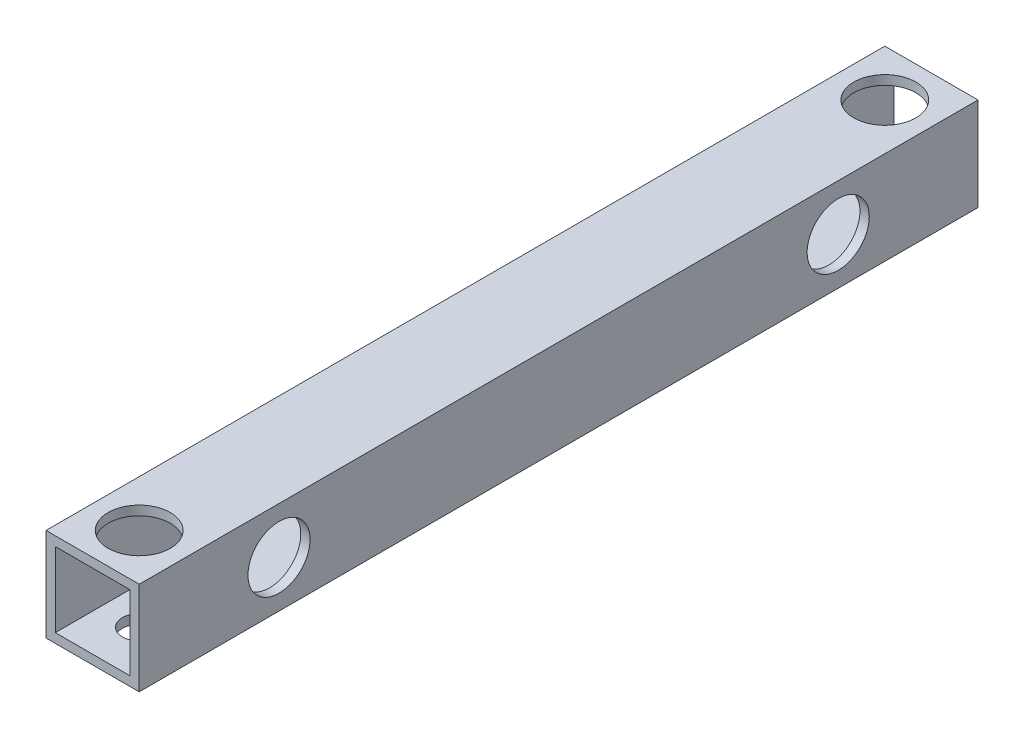
ISO-10303-21;
HEADER;
FILE_DESCRIPTION(('STEP AP214'),'2;1');
FILE_NAME('part.step','',(''),(''),'','','');
FILE_SCHEMA(('AUTOMOTIVE_DESIGN { 1 0 10303 214 1 1 1 1 }'));
ENDSEC;
DATA;
#1=APPLICATION_CONTEXT('core data for automotive mechanical design processes');
#2=APPLICATION_PROTOCOL_DEFINITION('international standard','automotive_design',2000,#1);
#3=PRODUCT_CONTEXT('',#1,'mechanical');
#4=PRODUCT('Part','Part','',(#3));
#5=PRODUCT_RELATED_PRODUCT_CATEGORY('part','',(#4));
#6=PRODUCT_DEFINITION_FORMATION('','',#4);
#7=PRODUCT_DEFINITION_CONTEXT('part definition',#1,'design');
#8=PRODUCT_DEFINITION('design','',#6,#7);
#9=PRODUCT_DEFINITION_SHAPE('','',#8);
#10=(LENGTH_UNIT() NAMED_UNIT(*) SI_UNIT(.MILLI.,.METRE.));
#11=(NAMED_UNIT(*) PLANE_ANGLE_UNIT() SI_UNIT($,.RADIAN.));
#12=(NAMED_UNIT(*) SI_UNIT($,.STERADIAN.) SOLID_ANGLE_UNIT());
#13=UNCERTAINTY_MEASURE_WITH_UNIT(LENGTH_MEASURE(1.E-05),#10,'distance_accuracy_value','');
#14=(GEOMETRIC_REPRESENTATION_CONTEXT(3) GLOBAL_UNCERTAINTY_ASSIGNED_CONTEXT((#13)) GLOBAL_UNIT_ASSIGNED_CONTEXT((#10,
#11,#12)) REPRESENTATION_CONTEXT('',''));
#15=CARTESIAN_POINT('',(0.,0.,0.));
#16=DIRECTION('',(0.,0.,1.));
#17=DIRECTION('',(1.,0.,0.));
#18=AXIS2_PLACEMENT_3D('',#15,#16,#17);
#19=CARTESIAN_POINT('',(0.,0.,135.));
#20=DIRECTION('',(0.,0.,-1.));
#21=DIRECTION('',(-1.,0.,0.));
#22=AXIS2_PLACEMENT_3D('',#19,#20,#21);
#23=PLANE('',#22);
#24=DIRECTION('',(0.,1.,0.));
#25=VECTOR('',#24,1.);
#26=CARTESIAN_POINT('',(7.5,-7.5,135.));
#27=LINE('',#26,#25);
#28=CARTESIAN_POINT('',(7.5,-7.5,135.));
#29=VERTEX_POINT('',#28);
#30=CARTESIAN_POINT('',(7.5,7.5,135.));
#31=VERTEX_POINT('',#30);
#32=EDGE_CURVE('E144',#29,#31,#27,.T.);
#33=ORIENTED_EDGE('',*,*,#32,.T.);
#34=DIRECTION('',(-1.,0.,0.));
#35=VECTOR('',#34,1.);
#36=CARTESIAN_POINT('',(-7.5,7.5,135.));
#37=LINE('',#36,#35);
#38=CARTESIAN_POINT('',(-7.5,7.5,135.));
#39=VERTEX_POINT('',#38);
#40=EDGE_CURVE('E147',#31,#39,#37,.T.);
#41=ORIENTED_EDGE('',*,*,#40,.T.);
#42=DIRECTION('',(0.,-1.,0.));
#43=VECTOR('',#42,1.);
#44=CARTESIAN_POINT('',(-7.5,-7.5,135.));
#45=LINE('',#44,#43);
#46=CARTESIAN_POINT('',(-7.5,-7.5,135.));
#47=VERTEX_POINT('',#46);
#48=EDGE_CURVE('E150',#39,#47,#45,.T.);
#49=ORIENTED_EDGE('',*,*,#48,.T.);
#50=DIRECTION('',(1.,0.,0.));
#51=VECTOR('',#50,1.);
#52=CARTESIAN_POINT('',(-7.5,-7.5,135.));
#53=LINE('',#52,#51);
#54=EDGE_CURVE('E152',#47,#29,#53,.T.);
#55=ORIENTED_EDGE('',*,*,#54,.T.);
#56=EDGE_LOOP('',(#33,#41,#49,#55));
#57=FACE_BOUND('',#56,.T.);
#58=DIRECTION('',(0.,1.,0.));
#59=VECTOR('',#58,1.);
#60=CARTESIAN_POINT('',(6.,-6.,135.));
#61=LINE('',#60,#59);
#62=CARTESIAN_POINT('',(6.,-6.,135.));
#63=VERTEX_POINT('',#62);
#64=CARTESIAN_POINT('',(6.,6.,135.));
#65=VERTEX_POINT('',#64);
#66=EDGE_CURVE('E106',#63,#65,#61,.T.);
#67=ORIENTED_EDGE('',*,*,#66,.F.);
#68=DIRECTION('',(1.,0.,0.));
#69=VECTOR('',#68,1.);
#70=CARTESIAN_POINT('',(-6.,-6.,135.));
#71=LINE('',#70,#69);
#72=CARTESIAN_POINT('',(-6.,-6.,135.));
#73=VERTEX_POINT('',#72);
#74=EDGE_CURVE('E128',#73,#63,#71,.T.);
#75=ORIENTED_EDGE('',*,*,#74,.F.);
#76=DIRECTION('',(0.,-1.,0.));
#77=VECTOR('',#76,1.);
#78=CARTESIAN_POINT('',(-6.,-6.,135.));
#79=LINE('',#78,#77);
#80=CARTESIAN_POINT('',(-6.,6.,135.));
#81=VERTEX_POINT('',#80);
#82=EDGE_CURVE('E126',#81,#73,#79,.T.);
#83=ORIENTED_EDGE('',*,*,#82,.F.);
#84=DIRECTION('',(-1.,0.,0.));
#85=VECTOR('',#84,1.);
#86=CARTESIAN_POINT('',(-6.,6.,135.));
#87=LINE('',#86,#85);
#88=EDGE_CURVE('E114',#65,#81,#87,.T.);
#89=ORIENTED_EDGE('',*,*,#88,.F.);
#90=EDGE_LOOP('',(#67,#75,#83,#89));
#91=FACE_BOUND('',#90,.T.);
#92=ADVANCED_FACE('F39',(#57,#91),#23,.F.);
#93=CARTESIAN_POINT('',(0.,0.,0.));
#94=DIRECTION('',(0.,0.,-1.));
#95=DIRECTION('',(-1.,0.,0.));
#96=AXIS2_PLACEMENT_3D('',#93,#94,#95);
#97=PLANE('',#96);
#98=DIRECTION('',(0.,1.,0.));
#99=VECTOR('',#98,1.);
#100=CARTESIAN_POINT('',(7.5,-7.5,0.));
#101=LINE('',#100,#99);
#102=CARTESIAN_POINT('',(7.5,-7.5,0.));
#103=VERTEX_POINT('',#102);
#104=CARTESIAN_POINT('',(7.5,7.5,0.));
#105=VERTEX_POINT('',#104);
#106=EDGE_CURVE('E122',#103,#105,#101,.T.);
#107=ORIENTED_EDGE('',*,*,#106,.F.);
#108=DIRECTION('',(1.,0.,0.));
#109=VECTOR('',#108,1.);
#110=CARTESIAN_POINT('',(-7.5,-7.5,0.));
#111=LINE('',#110,#109);
#112=CARTESIAN_POINT('',(-7.5,-7.5,0.));
#113=VERTEX_POINT('',#112);
#114=EDGE_CURVE('E148',#113,#103,#111,.T.);
#115=ORIENTED_EDGE('',*,*,#114,.F.);
#116=DIRECTION('',(0.,-1.,0.));
#117=VECTOR('',#116,1.);
#118=CARTESIAN_POINT('',(-7.5,-7.5,0.));
#119=LINE('',#118,#117);
#120=CARTESIAN_POINT('',(-7.5,7.5,0.));
#121=VERTEX_POINT('',#120);
#122=EDGE_CURVE('E159',#121,#113,#119,.T.);
#123=ORIENTED_EDGE('',*,*,#122,.F.);
#124=DIRECTION('',(-1.,0.,0.));
#125=VECTOR('',#124,1.);
#126=CARTESIAN_POINT('',(-7.5,7.5,0.));
#127=LINE('',#126,#125);
#128=EDGE_CURVE('E157',#105,#121,#127,.T.);
#129=ORIENTED_EDGE('',*,*,#128,.F.);
#130=EDGE_LOOP('',(#107,#115,#123,#129));
#131=FACE_BOUND('',#130,.T.);
#132=DIRECTION('',(1.,0.,0.));
#133=VECTOR('',#132,1.);
#134=CARTESIAN_POINT('',(-6.,-6.,0.));
#135=LINE('',#134,#133);
#136=CARTESIAN_POINT('',(-6.,-6.,0.));
#137=VERTEX_POINT('',#136);
#138=CARTESIAN_POINT('',(6.,-6.,0.));
#139=VERTEX_POINT('',#138);
#140=EDGE_CURVE('E115',#137,#139,#135,.T.);
#141=ORIENTED_EDGE('',*,*,#140,.T.);
#142=DIRECTION('',(0.,1.,0.));
#143=VECTOR('',#142,1.);
#144=CARTESIAN_POINT('',(6.,-6.,0.));
#145=LINE('',#144,#143);
#146=CARTESIAN_POINT('',(6.,6.,0.));
#147=VERTEX_POINT('',#146);
#148=EDGE_CURVE('E64',#139,#147,#145,.T.);
#149=ORIENTED_EDGE('',*,*,#148,.T.);
#150=DIRECTION('',(-1.,0.,0.));
#151=VECTOR('',#150,1.);
#152=CARTESIAN_POINT('',(-6.,6.,0.));
#153=LINE('',#152,#151);
#154=CARTESIAN_POINT('',(-6.,6.,0.));
#155=VERTEX_POINT('',#154);
#156=EDGE_CURVE('E121',#147,#155,#153,.T.);
#157=ORIENTED_EDGE('',*,*,#156,.T.);
#158=DIRECTION('',(0.,-1.,0.));
#159=VECTOR('',#158,1.);
#160=CARTESIAN_POINT('',(-6.,-6.,0.));
#161=LINE('',#160,#159);
#162=EDGE_CURVE('E136',#155,#137,#161,.T.);
#163=ORIENTED_EDGE('',*,*,#162,.T.);
#164=EDGE_LOOP('',(#141,#149,#157,#163));
#165=FACE_BOUND('',#164,.T.);
#166=ADVANCED_FACE('F238',(#131,#165),#97,.T.);
#167=CARTESIAN_POINT('',(7.5,-7.5,135.));
#168=DIRECTION('',(-1.,0.,0.));
#169=DIRECTION('',(0.,0.,1.));
#170=AXIS2_PLACEMENT_3D('',#167,#168,#169);
#171=PLANE('',#170);
#172=CARTESIAN_POINT('',(7.5,0.,22.5));
#173=DIRECTION('',(1.,0.,0.));
#174=DIRECTION('',(0.,0.,-1.));
#175=AXIS2_PLACEMENT_3D('',#172,#173,#174);
#176=CIRCLE('',#175,5.);
#177=CARTESIAN_POINT('',(7.5,0.,17.5));
#178=VERTEX_POINT('',#177);
#179=EDGE_CURVE('E192',#178,#178,#176,.T.);
#180=ORIENTED_EDGE('',*,*,#179,.F.);
#181=EDGE_LOOP('',(#180));
#182=FACE_BOUND('',#181,.T.);
#183=CARTESIAN_POINT('',(7.5,0.,112.5));
#184=DIRECTION('',(1.,0.,0.));
#185=DIRECTION('',(0.,0.,-1.));
#186=AXIS2_PLACEMENT_3D('',#183,#184,#185);
#187=CIRCLE('',#186,5.);
#188=CARTESIAN_POINT('',(7.5,0.,107.5));
#189=VERTEX_POINT('',#188);
#190=EDGE_CURVE('E198',#189,#189,#187,.T.);
#191=ORIENTED_EDGE('',*,*,#190,.F.);
#192=EDGE_LOOP('',(#191));
#193=FACE_BOUND('',#192,.T.);
#194=ORIENTED_EDGE('',*,*,#106,.T.);
#195=DIRECTION('',(0.,0.,-1.));
#196=VECTOR('',#195,1.);
#197=CARTESIAN_POINT('',(7.5,7.5,135.));
#198=LINE('',#197,#196);
#199=EDGE_CURVE('E11',#31,#105,#198,.T.);
#200=ORIENTED_EDGE('',*,*,#199,.F.);
#201=ORIENTED_EDGE('',*,*,#32,.F.);
#202=DIRECTION('',(0.,0.,-1.));
#203=VECTOR('',#202,1.);
#204=CARTESIAN_POINT('',(7.5,-7.5,135.));
#205=LINE('',#204,#203);
#206=EDGE_CURVE('E154',#29,#103,#205,.T.);
#207=ORIENTED_EDGE('',*,*,#206,.T.);
#208=EDGE_LOOP('',(#194,#200,#201,#207));
#209=FACE_BOUND('',#208,.T.);
#210=ADVANCED_FACE('F41',(#182,#193,#209),#171,.F.);
#211=CARTESIAN_POINT('',(-7.5,7.5,135.));
#212=DIRECTION('',(0.,-1.,0.));
#213=DIRECTION('',(0.,0.,-1.));
#214=AXIS2_PLACEMENT_3D('',#211,#212,#213);
#215=PLANE('',#214);
#216=CARTESIAN_POINT('',(0.,7.5,127.5));
#217=DIRECTION('',(0.,1.,0.));
#218=DIRECTION('',(0.,0.,1.));
#219=AXIS2_PLACEMENT_3D('',#216,#217,#218);
#220=CIRCLE('',#219,5.);
#221=CARTESIAN_POINT('',(0.,7.5,132.5));
#222=VERTEX_POINT('',#221);
#223=EDGE_CURVE('E188',#222,#222,#220,.T.);
#224=ORIENTED_EDGE('',*,*,#223,.F.);
#225=EDGE_LOOP('',(#224));
#226=FACE_BOUND('',#225,.T.);
#227=CARTESIAN_POINT('',(0.,7.5,7.50000000000001));
#228=DIRECTION('',(0.,1.,0.));
#229=DIRECTION('',(0.,0.,1.));
#230=AXIS2_PLACEMENT_3D('',#227,#228,#229);
#231=CIRCLE('',#230,5.);
#232=CARTESIAN_POINT('',(0.,7.5,12.5));
#233=VERTEX_POINT('',#232);
#234=EDGE_CURVE('E196',#233,#233,#231,.T.);
#235=ORIENTED_EDGE('',*,*,#234,.F.);
#236=EDGE_LOOP('',(#235));
#237=FACE_BOUND('',#236,.T.);
#238=ORIENTED_EDGE('',*,*,#128,.T.);
#239=DIRECTION('',(0.,0.,-1.));
#240=VECTOR('',#239,1.);
#241=CARTESIAN_POINT('',(-7.5,7.5,135.));
#242=LINE('',#241,#240);
#243=EDGE_CURVE('E48',#39,#121,#242,.T.);
#244=ORIENTED_EDGE('',*,*,#243,.F.);
#245=ORIENTED_EDGE('',*,*,#40,.F.);
#246=ORIENTED_EDGE('',*,*,#199,.T.);
#247=EDGE_LOOP('',(#238,#244,#245,#246));
#248=FACE_BOUND('',#247,.T.);
#249=ADVANCED_FACE('F253',(#226,#237,#248),#215,.F.);
#250=CARTESIAN_POINT('',(-7.5,-7.5,135.));
#251=DIRECTION('',(1.,0.,0.));
#252=DIRECTION('',(0.,0.,-1.));
#253=AXIS2_PLACEMENT_3D('',#250,#251,#252);
#254=PLANE('',#253);
#255=CARTESIAN_POINT('',(-7.5,0.,112.5));
#256=DIRECTION('',(1.,0.,0.));
#257=DIRECTION('',(0.,0.,-1.));
#258=AXIS2_PLACEMENT_3D('',#255,#256,#257);
#259=CIRCLE('',#258,2.7);
#260=CARTESIAN_POINT('',(-7.5,0.,109.8));
#261=VERTEX_POINT('',#260);
#262=EDGE_CURVE('E134',#261,#261,#259,.T.);
#263=ORIENTED_EDGE('',*,*,#262,.T.);
#264=EDGE_LOOP('',(#263));
#265=FACE_BOUND('',#264,.T.);
#266=CARTESIAN_POINT('',(-7.5,0.,22.5));
#267=DIRECTION('',(1.,0.,0.));
#268=DIRECTION('',(0.,0.,-1.));
#269=AXIS2_PLACEMENT_3D('',#266,#267,#268);
#270=CIRCLE('',#269,2.7);
#271=CARTESIAN_POINT('',(-7.5,0.,19.8));
#272=VERTEX_POINT('',#271);
#273=EDGE_CURVE('E172',#272,#272,#270,.T.);
#274=ORIENTED_EDGE('',*,*,#273,.T.);
#275=EDGE_LOOP('',(#274));
#276=FACE_BOUND('',#275,.T.);
#277=ORIENTED_EDGE('',*,*,#122,.T.);
#278=DIRECTION('',(0.,0.,-1.));
#279=VECTOR('',#278,1.);
#280=CARTESIAN_POINT('',(-7.5,-7.5,135.));
#281=LINE('',#280,#279);
#282=EDGE_CURVE('E164',#47,#113,#281,.T.);
#283=ORIENTED_EDGE('',*,*,#282,.F.);
#284=ORIENTED_EDGE('',*,*,#48,.F.);
#285=ORIENTED_EDGE('',*,*,#243,.T.);
#286=EDGE_LOOP('',(#277,#283,#284,#285));
#287=FACE_BOUND('',#286,.T.);
#288=ADVANCED_FACE('F217',(#265,#276,#287),#254,.F.);
#289=CARTESIAN_POINT('',(-7.5,-7.5,135.));
#290=DIRECTION('',(0.,1.,0.));
#291=DIRECTION('',(0.,0.,1.));
#292=AXIS2_PLACEMENT_3D('',#289,#290,#291);
#293=PLANE('',#292);
#294=CARTESIAN_POINT('',(0.,-7.5,7.50000000000001));
#295=DIRECTION('',(0.,1.,0.));
#296=DIRECTION('',(0.,0.,1.));
#297=AXIS2_PLACEMENT_3D('',#294,#295,#296);
#298=CIRCLE('',#297,2.7);
#299=CARTESIAN_POINT('',(0.,-7.5,10.2));
#300=VERTEX_POINT('',#299);
#301=EDGE_CURVE('E173',#300,#300,#298,.T.);
#302=ORIENTED_EDGE('',*,*,#301,.T.);
#303=EDGE_LOOP('',(#302));
#304=FACE_BOUND('',#303,.T.);
#305=CARTESIAN_POINT('',(0.,-7.5,127.5));
#306=DIRECTION('',(0.,1.,0.));
#307=DIRECTION('',(0.,0.,1.));
#308=AXIS2_PLACEMENT_3D('',#305,#306,#307);
#309=CIRCLE('',#308,2.7);
#310=CARTESIAN_POINT('',(0.,-7.5,130.2));
#311=VERTEX_POINT('',#310);
#312=EDGE_CURVE('E180',#311,#311,#309,.T.);
#313=ORIENTED_EDGE('',*,*,#312,.T.);
#314=EDGE_LOOP('',(#313));
#315=FACE_BOUND('',#314,.T.);
#316=ORIENTED_EDGE('',*,*,#114,.T.);
#317=ORIENTED_EDGE('',*,*,#206,.F.);
#318=ORIENTED_EDGE('',*,*,#54,.F.);
#319=ORIENTED_EDGE('',*,*,#282,.T.);
#320=EDGE_LOOP('',(#316,#317,#318,#319));
#321=FACE_BOUND('',#320,.T.);
#322=ADVANCED_FACE('F249',(#304,#315,#321),#293,.F.);
#323=CARTESIAN_POINT('',(6.,-6.,135.));
#324=DIRECTION('',(-1.,0.,0.));
#325=DIRECTION('',(0.,0.,1.));
#326=AXIS2_PLACEMENT_3D('',#323,#324,#325);
#327=PLANE('',#326);
#328=CARTESIAN_POINT('',(6.,0.,22.5));
#329=DIRECTION('',(-1.,0.,0.));
#330=DIRECTION('',(0.,0.,1.));
#331=AXIS2_PLACEMENT_3D('',#328,#329,#330);
#332=CIRCLE('',#331,5.);
#333=CARTESIAN_POINT('',(6.,0.,27.5));
#334=VERTEX_POINT('',#333);
#335=EDGE_CURVE('E43',#334,#334,#332,.T.);
#336=ORIENTED_EDGE('',*,*,#335,.F.);
#337=EDGE_LOOP('',(#336));
#338=FACE_BOUND('',#337,.T.);
#339=CARTESIAN_POINT('',(6.,0.,112.5));
#340=DIRECTION('',(-1.,0.,0.));
#341=DIRECTION('',(0.,0.,1.));
#342=AXIS2_PLACEMENT_3D('',#339,#340,#341);
#343=CIRCLE('',#342,5.);
#344=CARTESIAN_POINT('',(6.,0.,117.5));
#345=VERTEX_POINT('',#344);
#346=EDGE_CURVE('E190',#345,#345,#343,.T.);
#347=ORIENTED_EDGE('',*,*,#346,.F.);
#348=EDGE_LOOP('',(#347));
#349=FACE_BOUND('',#348,.T.);
#350=ORIENTED_EDGE('',*,*,#148,.F.);
#351=DIRECTION('',(0.,0.,-1.));
#352=VECTOR('',#351,1.);
#353=CARTESIAN_POINT('',(6.,-6.,135.));
#354=LINE('',#353,#352);
#355=EDGE_CURVE('E110',#63,#139,#354,.T.);
#356=ORIENTED_EDGE('',*,*,#355,.F.);
#357=ORIENTED_EDGE('',*,*,#66,.T.);
#358=DIRECTION('',(0.,0.,-1.));
#359=VECTOR('',#358,1.);
#360=CARTESIAN_POINT('',(6.,6.,135.));
#361=LINE('',#360,#359);
#362=EDGE_CURVE('E109',#65,#147,#361,.T.);
#363=ORIENTED_EDGE('',*,*,#362,.T.);
#364=EDGE_LOOP('',(#350,#356,#357,#363));
#365=FACE_BOUND('',#364,.T.);
#366=ADVANCED_FACE('F108',(#338,#349,#365),#327,.T.);
#367=CARTESIAN_POINT('',(-6.,6.,135.));
#368=DIRECTION('',(0.,-1.,0.));
#369=DIRECTION('',(0.,0.,-1.));
#370=AXIS2_PLACEMENT_3D('',#367,#368,#369);
#371=PLANE('',#370);
#372=CARTESIAN_POINT('',(0.,6.,127.5));
#373=DIRECTION('',(0.,-1.,0.));
#374=DIRECTION('',(0.,0.,-1.));
#375=AXIS2_PLACEMENT_3D('',#372,#373,#374);
#376=CIRCLE('',#375,5.);
#377=CARTESIAN_POINT('',(0.,6.,122.5));
#378=VERTEX_POINT('',#377);
#379=EDGE_CURVE('E181',#378,#378,#376,.T.);
#380=ORIENTED_EDGE('',*,*,#379,.F.);
#381=EDGE_LOOP('',(#380));
#382=FACE_BOUND('',#381,.T.);
#383=CARTESIAN_POINT('',(0.,6.,7.50000000000001));
#384=DIRECTION('',(0.,-1.,0.));
#385=DIRECTION('',(0.,0.,-1.));
#386=AXIS2_PLACEMENT_3D('',#383,#384,#385);
#387=CIRCLE('',#386,5.);
#388=CARTESIAN_POINT('',(0.,6.,2.50000000000001));
#389=VERTEX_POINT('',#388);
#390=EDGE_CURVE('E185',#389,#389,#387,.T.);
#391=ORIENTED_EDGE('',*,*,#390,.F.);
#392=EDGE_LOOP('',(#391));
#393=FACE_BOUND('',#392,.T.);
#394=ORIENTED_EDGE('',*,*,#156,.F.);
#395=ORIENTED_EDGE('',*,*,#362,.F.);
#396=ORIENTED_EDGE('',*,*,#88,.T.);
#397=DIRECTION('',(0.,0.,-1.));
#398=VECTOR('',#397,1.);
#399=CARTESIAN_POINT('',(-6.,6.,135.));
#400=LINE('',#399,#398);
#401=EDGE_CURVE('E123',#81,#155,#400,.T.);
#402=ORIENTED_EDGE('',*,*,#401,.T.);
#403=EDGE_LOOP('',(#394,#395,#396,#402));
#404=FACE_BOUND('',#403,.T.);
#405=ADVANCED_FACE('F118',(#382,#393,#404),#371,.T.);
#406=CARTESIAN_POINT('',(-6.,-6.,135.));
#407=DIRECTION('',(1.,0.,0.));
#408=DIRECTION('',(0.,0.,-1.));
#409=AXIS2_PLACEMENT_3D('',#406,#407,#408);
#410=PLANE('',#409);
#411=CARTESIAN_POINT('',(-6.,0.,112.5));
#412=DIRECTION('',(1.,0.,0.));
#413=DIRECTION('',(0.,0.,-1.));
#414=AXIS2_PLACEMENT_3D('',#411,#412,#413);
#415=CIRCLE('',#414,2.7);
#416=CARTESIAN_POINT('',(-6.,0.,109.8));
#417=VERTEX_POINT('',#416);
#418=EDGE_CURVE('E174',#417,#417,#415,.T.);
#419=ORIENTED_EDGE('',*,*,#418,.F.);
#420=EDGE_LOOP('',(#419));
#421=FACE_BOUND('',#420,.T.);
#422=CARTESIAN_POINT('',(-6.,0.,22.5));
#423=DIRECTION('',(1.,0.,0.));
#424=DIRECTION('',(0.,0.,-1.));
#425=AXIS2_PLACEMENT_3D('',#422,#423,#424);
#426=CIRCLE('',#425,2.7);
#427=CARTESIAN_POINT('',(-6.,0.,19.8));
#428=VERTEX_POINT('',#427);
#429=EDGE_CURVE('E169',#428,#428,#426,.T.);
#430=ORIENTED_EDGE('',*,*,#429,.F.);
#431=EDGE_LOOP('',(#430));
#432=FACE_BOUND('',#431,.T.);
#433=ORIENTED_EDGE('',*,*,#162,.F.);
#434=ORIENTED_EDGE('',*,*,#401,.F.);
#435=ORIENTED_EDGE('',*,*,#82,.T.);
#436=DIRECTION('',(0.,0.,-1.));
#437=VECTOR('',#436,1.);
#438=CARTESIAN_POINT('',(-6.,-6.,135.));
#439=LINE('',#438,#437);
#440=EDGE_CURVE('E56',#73,#137,#439,.T.);
#441=ORIENTED_EDGE('',*,*,#440,.T.);
#442=EDGE_LOOP('',(#433,#434,#435,#441));
#443=FACE_BOUND('',#442,.T.);
#444=ADVANCED_FACE('F282',(#421,#432,#443),#410,.T.);
#445=CARTESIAN_POINT('',(-6.,-6.,135.));
#446=DIRECTION('',(0.,1.,0.));
#447=DIRECTION('',(0.,0.,1.));
#448=AXIS2_PLACEMENT_3D('',#445,#446,#447);
#449=PLANE('',#448);
#450=CARTESIAN_POINT('',(0.,-6.,7.50000000000001));
#451=DIRECTION('',(0.,1.,0.));
#452=DIRECTION('',(0.,0.,1.));
#453=AXIS2_PLACEMENT_3D('',#450,#451,#452);
#454=CIRCLE('',#453,2.7);
#455=CARTESIAN_POINT('',(0.,-6.,10.2));
#456=VERTEX_POINT('',#455);
#457=EDGE_CURVE('E182',#456,#456,#454,.T.);
#458=ORIENTED_EDGE('',*,*,#457,.F.);
#459=EDGE_LOOP('',(#458));
#460=FACE_BOUND('',#459,.T.);
#461=CARTESIAN_POINT('',(0.,-6.,127.5));
#462=DIRECTION('',(0.,1.,0.));
#463=DIRECTION('',(0.,0.,1.));
#464=AXIS2_PLACEMENT_3D('',#461,#462,#463);
#465=CIRCLE('',#464,2.7);
#466=CARTESIAN_POINT('',(0.,-6.,130.2));
#467=VERTEX_POINT('',#466);
#468=EDGE_CURVE('E177',#467,#467,#465,.T.);
#469=ORIENTED_EDGE('',*,*,#468,.F.);
#470=EDGE_LOOP('',(#469));
#471=FACE_BOUND('',#470,.T.);
#472=ORIENTED_EDGE('',*,*,#140,.F.);
#473=ORIENTED_EDGE('',*,*,#440,.F.);
#474=ORIENTED_EDGE('',*,*,#74,.T.);
#475=ORIENTED_EDGE('',*,*,#355,.T.);
#476=EDGE_LOOP('',(#472,#473,#474,#475));
#477=FACE_BOUND('',#476,.T.);
#478=ADVANCED_FACE('F234',(#460,#471,#477),#449,.T.);
#479=CARTESIAN_POINT('',(-17.5,0.,22.5));
#480=DIRECTION('',(1.,0.,0.));
#481=DIRECTION('',(0.,0.,-1.));
#482=AXIS2_PLACEMENT_3D('',#479,#480,#481);
#483=CYLINDRICAL_SURFACE('',#482,2.7);
#484=ORIENTED_EDGE('',*,*,#429,.T.);
#485=EDGE_LOOP('',(#484));
#486=FACE_BOUND('',#485,.T.);
#487=ORIENTED_EDGE('',*,*,#273,.F.);
#488=EDGE_LOOP('',(#487));
#489=FACE_BOUND('',#488,.T.);
#490=ADVANCED_FACE('F223',(#486,#489),#483,.F.);
#491=CARTESIAN_POINT('',(-17.5,0.,112.5));
#492=DIRECTION('',(1.,0.,0.));
#493=DIRECTION('',(0.,0.,-1.));
#494=AXIS2_PLACEMENT_3D('',#491,#492,#493);
#495=CYLINDRICAL_SURFACE('',#494,2.7);
#496=ORIENTED_EDGE('',*,*,#418,.T.);
#497=EDGE_LOOP('',(#496));
#498=FACE_BOUND('',#497,.T.);
#499=ORIENTED_EDGE('',*,*,#262,.F.);
#500=EDGE_LOOP('',(#499));
#501=FACE_BOUND('',#500,.T.);
#502=ADVANCED_FACE('F220',(#498,#501),#495,.F.);
#503=CARTESIAN_POINT('',(0.,-17.5,127.5));
#504=DIRECTION('',(0.,1.,0.));
#505=DIRECTION('',(0.,0.,1.));
#506=AXIS2_PLACEMENT_3D('',#503,#504,#505);
#507=CYLINDRICAL_SURFACE('',#506,2.7);
#508=ORIENTED_EDGE('',*,*,#468,.T.);
#509=EDGE_LOOP('',(#508));
#510=FACE_BOUND('',#509,.T.);
#511=ORIENTED_EDGE('',*,*,#312,.F.);
#512=EDGE_LOOP('',(#511));
#513=FACE_BOUND('',#512,.T.);
#514=ADVANCED_FACE('F222',(#510,#513),#507,.F.);
#515=CARTESIAN_POINT('',(0.,-17.5,7.50000000000001));
#516=DIRECTION('',(0.,1.,0.));
#517=DIRECTION('',(0.,0.,1.));
#518=AXIS2_PLACEMENT_3D('',#515,#516,#517);
#519=CYLINDRICAL_SURFACE('',#518,2.7);
#520=ORIENTED_EDGE('',*,*,#457,.T.);
#521=EDGE_LOOP('',(#520));
#522=FACE_BOUND('',#521,.T.);
#523=ORIENTED_EDGE('',*,*,#301,.F.);
#524=EDGE_LOOP('',(#523));
#525=FACE_BOUND('',#524,.T.);
#526=ADVANCED_FACE('F231',(#522,#525),#519,.F.);
#527=CARTESIAN_POINT('',(0.,-2.5,7.50000000000001));
#528=DIRECTION('',(0.,1.,0.));
#529=DIRECTION('',(0.,0.,1.));
#530=AXIS2_PLACEMENT_3D('',#527,#528,#529);
#531=CYLINDRICAL_SURFACE('',#530,5.);
#532=ORIENTED_EDGE('',*,*,#390,.T.);
#533=EDGE_LOOP('',(#532));
#534=FACE_BOUND('',#533,.T.);
#535=ORIENTED_EDGE('',*,*,#234,.T.);
#536=EDGE_LOOP('',(#535));
#537=FACE_BOUND('',#536,.T.);
#538=ADVANCED_FACE('F302',(#534,#537),#531,.F.);
#539=CARTESIAN_POINT('',(0.,-2.5,127.5));
#540=DIRECTION('',(0.,1.,0.));
#541=DIRECTION('',(0.,0.,1.));
#542=AXIS2_PLACEMENT_3D('',#539,#540,#541);
#543=CYLINDRICAL_SURFACE('',#542,5.);
#544=ORIENTED_EDGE('',*,*,#379,.T.);
#545=EDGE_LOOP('',(#544));
#546=FACE_BOUND('',#545,.T.);
#547=ORIENTED_EDGE('',*,*,#223,.T.);
#548=EDGE_LOOP('',(#547));
#549=FACE_BOUND('',#548,.T.);
#550=ADVANCED_FACE('F304',(#546,#549),#543,.F.);
#551=CARTESIAN_POINT('',(-2.5,0.,112.5));
#552=DIRECTION('',(1.,0.,0.));
#553=DIRECTION('',(0.,0.,-1.));
#554=AXIS2_PLACEMENT_3D('',#551,#552,#553);
#555=CYLINDRICAL_SURFACE('',#554,5.);
#556=ORIENTED_EDGE('',*,*,#346,.T.);
#557=EDGE_LOOP('',(#556));
#558=FACE_BOUND('',#557,.T.);
#559=ORIENTED_EDGE('',*,*,#190,.T.);
#560=EDGE_LOOP('',(#559));
#561=FACE_BOUND('',#560,.T.);
#562=ADVANCED_FACE('F309',(#558,#561),#555,.F.);
#563=CARTESIAN_POINT('',(-2.5,0.,22.5));
#564=DIRECTION('',(1.,0.,0.));
#565=DIRECTION('',(0.,0.,-1.));
#566=AXIS2_PLACEMENT_3D('',#563,#564,#565);
#567=CYLINDRICAL_SURFACE('',#566,5.);
#568=ORIENTED_EDGE('',*,*,#335,.T.);
#569=EDGE_LOOP('',(#568));
#570=FACE_BOUND('',#569,.T.);
#571=ORIENTED_EDGE('',*,*,#179,.T.);
#572=EDGE_LOOP('',(#571));
#573=FACE_BOUND('',#572,.T.);
#574=ADVANCED_FACE('F317',(#570,#573),#567,.F.);
#575=CLOSED_SHELL('',(#92,#166,#210,#249,#288,#322,#366,#405,#444,#478,#490,#502,#514,#526,#538,
#550,#562,#574));
#576=MANIFOLD_SOLID_BREP('B2',#575);
#577=ADVANCED_BREP_SHAPE_REPRESENTATION('',(#18,#576),#14);
#578=SHAPE_DEFINITION_REPRESENTATION(#9,#577);
ENDSEC;
END-ISO-10303-21;
